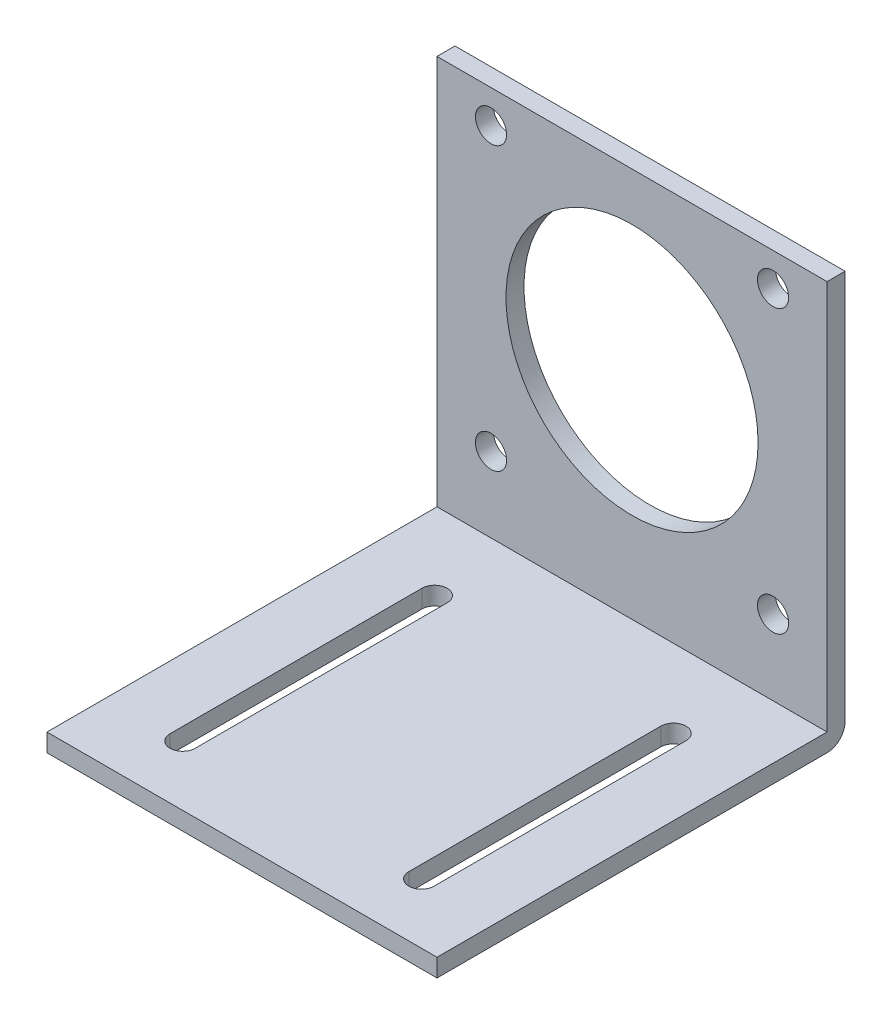
ISO-10303-21;
HEADER;
FILE_DESCRIPTION(('STEP AP214'),'2;1');
FILE_NAME('part.step','',(''),(''),'','','');
FILE_SCHEMA(('AUTOMOTIVE_DESIGN { 1 0 10303 214 1 1 1 1 }'));
ENDSEC;
DATA;
#1=APPLICATION_CONTEXT('core data for automotive mechanical design processes');
#2=APPLICATION_PROTOCOL_DEFINITION('international standard','automotive_design',2000,#1);
#3=PRODUCT_CONTEXT('',#1,'mechanical');
#4=PRODUCT('Part','Part','',(#3));
#5=PRODUCT_RELATED_PRODUCT_CATEGORY('part','',(#4));
#6=PRODUCT_DEFINITION_FORMATION('','',#4);
#7=PRODUCT_DEFINITION_CONTEXT('part definition',#1,'design');
#8=PRODUCT_DEFINITION('design','',#6,#7);
#9=PRODUCT_DEFINITION_SHAPE('','',#8);
#10=(LENGTH_UNIT() NAMED_UNIT(*) SI_UNIT(.MILLI.,.METRE.));
#11=(NAMED_UNIT(*) PLANE_ANGLE_UNIT() SI_UNIT($,.RADIAN.));
#12=(NAMED_UNIT(*) SI_UNIT($,.STERADIAN.) SOLID_ANGLE_UNIT());
#13=UNCERTAINTY_MEASURE_WITH_UNIT(LENGTH_MEASURE(1.E-05),#10,'distance_accuracy_value','');
#14=(GEOMETRIC_REPRESENTATION_CONTEXT(3) GLOBAL_UNCERTAINTY_ASSIGNED_CONTEXT((#13)) GLOBAL_UNIT_ASSIGNED_CONTEXT((#10,
#11,#12)) REPRESENTATION_CONTEXT('',''));
#15=CARTESIAN_POINT('',(0.,0.,0.));
#16=DIRECTION('',(0.,0.,1.));
#17=DIRECTION('',(1.,0.,0.));
#18=AXIS2_PLACEMENT_3D('',#15,#16,#17);
#19=CARTESIAN_POINT('',(0.,0.,3.));
#20=DIRECTION('',(0.,0.,1.));
#21=DIRECTION('',(1.,0.,0.));
#22=AXIS2_PLACEMENT_3D('',#19,#20,#21);
#23=PLANE('',#22);
#24=DIRECTION('',(-1.,0.,0.));
#25=VECTOR('',#24,1.);
#26=CARTESIAN_POINT('',(-32.5,-31.,3.));
#27=LINE('',#26,#25);
#28=CARTESIAN_POINT('',(32.5,-31.,3.));
#29=VERTEX_POINT('',#28);
#30=CARTESIAN_POINT('',(-32.5,-31.,3.));
#31=VERTEX_POINT('',#30);
#32=EDGE_CURVE('E245',#29,#31,#27,.T.);
#33=ORIENTED_EDGE('',*,*,#32,.F.);
#34=DIRECTION('',(0.,1.,0.));
#35=VECTOR('',#34,1.);
#36=CARTESIAN_POINT('',(32.5,34.,3.));
#37=LINE('',#36,#35);
#38=CARTESIAN_POINT('',(32.5,34.,3.));
#39=VERTEX_POINT('',#38);
#40=EDGE_CURVE('E312',#29,#39,#37,.T.);
#41=ORIENTED_EDGE('',*,*,#40,.T.);
#42=DIRECTION('',(-1.,0.,0.));
#43=VECTOR('',#42,1.);
#44=CARTESIAN_POINT('',(-32.5,34.,3.));
#45=LINE('',#44,#43);
#46=CARTESIAN_POINT('',(-32.5,34.,3.));
#47=VERTEX_POINT('',#46);
#48=EDGE_CURVE('E315',#39,#47,#45,.T.);
#49=ORIENTED_EDGE('',*,*,#48,.T.);
#50=DIRECTION('',(0.,-1.,0.));
#51=VECTOR('',#50,1.);
#52=CARTESIAN_POINT('',(-32.5,34.,3.));
#53=LINE('',#52,#51);
#54=EDGE_CURVE('E319',#47,#31,#53,.T.);
#55=ORIENTED_EDGE('',*,*,#54,.T.);
#56=EDGE_LOOP('',(#33,#41,#49,#55));
#57=FACE_BOUND('',#56,.T.);
#58=CARTESIAN_POINT('',(-23.5,-18.5,3.));
#59=DIRECTION('',(0.,0.,1.));
#60=DIRECTION('',(1.,0.,0.));
#61=AXIS2_PLACEMENT_3D('',#58,#59,#60);
#62=CIRCLE('',#61,2.6);
#63=CARTESIAN_POINT('',(-20.9,-18.5,3.));
#64=VERTEX_POINT('',#63);
#65=EDGE_CURVE('E280',#64,#64,#62,.T.);
#66=ORIENTED_EDGE('',*,*,#65,.F.);
#67=EDGE_LOOP('',(#66));
#68=FACE_BOUND('',#67,.T.);
#69=CARTESIAN_POINT('',(23.5,28.5,3.));
#70=DIRECTION('',(0.,0.,1.));
#71=DIRECTION('',(1.,0.,0.));
#72=AXIS2_PLACEMENT_3D('',#69,#70,#71);
#73=CIRCLE('',#72,2.6);
#74=CARTESIAN_POINT('',(26.1,28.5,3.));
#75=VERTEX_POINT('',#74);
#76=EDGE_CURVE('E296',#75,#75,#73,.T.);
#77=ORIENTED_EDGE('',*,*,#76,.F.);
#78=EDGE_LOOP('',(#77));
#79=FACE_BOUND('',#78,.T.);
#80=CARTESIAN_POINT('',(0.,4.99999999999999,3.));
#81=DIRECTION('',(0.,0.,1.));
#82=DIRECTION('',(1.,0.,0.));
#83=AXIS2_PLACEMENT_3D('',#80,#81,#82);
#84=CIRCLE('',#83,21.);
#85=CARTESIAN_POINT('',(21.,4.99999999999999,3.));
#86=VERTEX_POINT('',#85);
#87=EDGE_CURVE('E304',#86,#86,#84,.T.);
#88=ORIENTED_EDGE('',*,*,#87,.F.);
#89=EDGE_LOOP('',(#88));
#90=FACE_BOUND('',#89,.T.);
#91=CARTESIAN_POINT('',(-23.5,28.5,3.));
#92=DIRECTION('',(0.,0.,1.));
#93=DIRECTION('',(1.,0.,0.));
#94=AXIS2_PLACEMENT_3D('',#91,#92,#93);
#95=CIRCLE('',#94,2.6);
#96=CARTESIAN_POINT('',(-20.9,28.5,3.));
#97=VERTEX_POINT('',#96);
#98=EDGE_CURVE('E288',#97,#97,#95,.T.);
#99=ORIENTED_EDGE('',*,*,#98,.F.);
#100=EDGE_LOOP('',(#99));
#101=FACE_BOUND('',#100,.T.);
#102=CARTESIAN_POINT('',(23.5,-18.5,3.));
#103=DIRECTION('',(0.,0.,1.));
#104=DIRECTION('',(1.,0.,0.));
#105=AXIS2_PLACEMENT_3D('',#102,#103,#104);
#106=CIRCLE('',#105,2.6);
#107=CARTESIAN_POINT('',(26.1,-18.5,3.));
#108=VERTEX_POINT('',#107);
#109=EDGE_CURVE('E272',#108,#108,#106,.T.);
#110=ORIENTED_EDGE('',*,*,#109,.F.);
#111=EDGE_LOOP('',(#110));
#112=FACE_BOUND('',#111,.T.);
#113=ADVANCED_FACE('F39',(#57,#68,#79,#90,#101,#112),#23,.T.);
#114=CARTESIAN_POINT('',(0.,0.,0.));
#115=DIRECTION('',(0.,0.,1.));
#116=DIRECTION('',(1.,0.,0.));
#117=AXIS2_PLACEMENT_3D('',#114,#115,#116);
#118=PLANE('',#117);
#119=DIRECTION('',(0.,1.,0.));
#120=VECTOR('',#119,1.);
#121=CARTESIAN_POINT('',(32.5,34.,0.));
#122=LINE('',#121,#120);
#123=CARTESIAN_POINT('',(32.5,-31.,0.));
#124=VERTEX_POINT('',#123);
#125=CARTESIAN_POINT('',(32.5,34.,0.));
#126=VERTEX_POINT('',#125);
#127=EDGE_CURVE('E308',#124,#126,#122,.T.);
#128=ORIENTED_EDGE('',*,*,#127,.F.);
#129=DIRECTION('',(1.,0.,0.));
#130=VECTOR('',#129,1.);
#131=CARTESIAN_POINT('',(0.,-31.,0.));
#132=LINE('',#131,#130);
#133=CARTESIAN_POINT('',(-32.5,-31.,0.));
#134=VERTEX_POINT('',#133);
#135=EDGE_CURVE('E48',#124,#134,#132,.F.);
#136=ORIENTED_EDGE('',*,*,#135,.T.);
#137=DIRECTION('',(0.,-1.,0.));
#138=VECTOR('',#137,1.);
#139=CARTESIAN_POINT('',(-32.5,34.,0.));
#140=LINE('',#139,#138);
#141=CARTESIAN_POINT('',(-32.5,34.,0.));
#142=VERTEX_POINT('',#141);
#143=EDGE_CURVE('E316',#142,#134,#140,.T.);
#144=ORIENTED_EDGE('',*,*,#143,.F.);
#145=DIRECTION('',(-1.,0.,0.));
#146=VECTOR('',#145,1.);
#147=CARTESIAN_POINT('',(-32.5,34.,0.));
#148=LINE('',#147,#146);
#149=EDGE_CURVE('E325',#126,#142,#148,.T.);
#150=ORIENTED_EDGE('',*,*,#149,.F.);
#151=EDGE_LOOP('',(#128,#136,#144,#150));
#152=FACE_BOUND('',#151,.T.);
#153=CARTESIAN_POINT('',(0.,4.99999999999999,0.));
#154=DIRECTION('',(0.,0.,1.));
#155=DIRECTION('',(1.,0.,0.));
#156=AXIS2_PLACEMENT_3D('',#153,#154,#155);
#157=CIRCLE('',#156,21.);
#158=CARTESIAN_POINT('',(21.,4.99999999999999,0.));
#159=VERTEX_POINT('',#158);
#160=EDGE_CURVE('E300',#159,#159,#157,.T.);
#161=ORIENTED_EDGE('',*,*,#160,.T.);
#162=EDGE_LOOP('',(#161));
#163=FACE_BOUND('',#162,.T.);
#164=CARTESIAN_POINT('',(23.5,28.5,0.));
#165=DIRECTION('',(0.,0.,1.));
#166=DIRECTION('',(1.,0.,0.));
#167=AXIS2_PLACEMENT_3D('',#164,#165,#166);
#168=CIRCLE('',#167,2.6);
#169=CARTESIAN_POINT('',(26.1,28.5,0.));
#170=VERTEX_POINT('',#169);
#171=EDGE_CURVE('E292',#170,#170,#168,.T.);
#172=ORIENTED_EDGE('',*,*,#171,.T.);
#173=EDGE_LOOP('',(#172));
#174=FACE_BOUND('',#173,.T.);
#175=CARTESIAN_POINT('',(-23.5,28.5,0.));
#176=DIRECTION('',(0.,0.,1.));
#177=DIRECTION('',(1.,0.,0.));
#178=AXIS2_PLACEMENT_3D('',#175,#176,#177);
#179=CIRCLE('',#178,2.6);
#180=CARTESIAN_POINT('',(-20.9,28.5,0.));
#181=VERTEX_POINT('',#180);
#182=EDGE_CURVE('E284',#181,#181,#179,.T.);
#183=ORIENTED_EDGE('',*,*,#182,.T.);
#184=EDGE_LOOP('',(#183));
#185=FACE_BOUND('',#184,.T.);
#186=CARTESIAN_POINT('',(-23.5,-18.5,0.));
#187=DIRECTION('',(0.,0.,1.));
#188=DIRECTION('',(1.,0.,0.));
#189=AXIS2_PLACEMENT_3D('',#186,#187,#188);
#190=CIRCLE('',#189,2.6);
#191=CARTESIAN_POINT('',(-20.9,-18.5,0.));
#192=VERTEX_POINT('',#191);
#193=EDGE_CURVE('E276',#192,#192,#190,.T.);
#194=ORIENTED_EDGE('',*,*,#193,.T.);
#195=EDGE_LOOP('',(#194));
#196=FACE_BOUND('',#195,.T.);
#197=CARTESIAN_POINT('',(23.5,-18.5,0.));
#198=DIRECTION('',(0.,0.,1.));
#199=DIRECTION('',(1.,0.,0.));
#200=AXIS2_PLACEMENT_3D('',#197,#198,#199);
#201=CIRCLE('',#200,2.6);
#202=CARTESIAN_POINT('',(26.1,-18.5,0.));
#203=VERTEX_POINT('',#202);
#204=EDGE_CURVE('E271',#203,#203,#201,.T.);
#205=ORIENTED_EDGE('',*,*,#204,.T.);
#206=EDGE_LOOP('',(#205));
#207=FACE_BOUND('',#206,.T.);
#208=ADVANCED_FACE('F374',(#152,#163,#174,#185,#196,#207),#118,.F.);
#209=CARTESIAN_POINT('',(32.5,34.,3.));
#210=DIRECTION('',(-1.,0.,0.));
#211=DIRECTION('',(0.,-1.,0.));
#212=AXIS2_PLACEMENT_3D('',#209,#210,#211);
#213=PLANE('',#212);
#214=DIRECTION('',(0.,0.,-1.));
#215=VECTOR('',#214,1.);
#216=CARTESIAN_POINT('',(32.5,-34.,3.));
#217=LINE('',#216,#215);
#218=CARTESIAN_POINT('',(32.5,-34.,68.));
#219=VERTEX_POINT('',#218);
#220=CARTESIAN_POINT('',(32.5,-34.,3.));
#221=VERTEX_POINT('',#220);
#222=EDGE_CURVE('E322',#219,#221,#217,.T.);
#223=ORIENTED_EDGE('',*,*,#222,.T.);
#224=CARTESIAN_POINT('',(32.5,-31.,3.));
#225=DIRECTION('',(-1.,0.,0.));
#226=DIRECTION('',(0.,-1.,0.));
#227=AXIS2_PLACEMENT_3D('',#224,#225,#226);
#228=CIRCLE('',#227,3.);
#229=EDGE_CURVE('E62',#221,#124,#228,.F.);
#230=ORIENTED_EDGE('',*,*,#229,.T.);
#231=ORIENTED_EDGE('',*,*,#127,.T.);
#232=DIRECTION('',(0.,0.,-1.));
#233=VECTOR('',#232,1.);
#234=CARTESIAN_POINT('',(32.5,34.,3.));
#235=LINE('',#234,#233);
#236=EDGE_CURVE('E340',#39,#126,#235,.T.);
#237=ORIENTED_EDGE('',*,*,#236,.F.);
#238=ORIENTED_EDGE('',*,*,#40,.F.);
#239=DIRECTION('',(0.,0.,-1.));
#240=VECTOR('',#239,1.);
#241=CARTESIAN_POINT('',(32.5,-31.,68.));
#242=LINE('',#241,#240);
#243=CARTESIAN_POINT('',(32.5,-31.,68.));
#244=VERTEX_POINT('',#243);
#245=EDGE_CURVE('E267',#244,#29,#242,.T.);
#246=ORIENTED_EDGE('',*,*,#245,.F.);
#247=DIRECTION('',(0.,1.,0.));
#248=VECTOR('',#247,1.);
#249=CARTESIAN_POINT('',(32.5,-34.,68.));
#250=LINE('',#249,#248);
#251=EDGE_CURVE('E254',#219,#244,#250,.T.);
#252=ORIENTED_EDGE('',*,*,#251,.F.);
#253=EDGE_LOOP('',(#223,#230,#231,#237,#238,#246,#252));
#254=FACE_BOUND('',#253,.T.);
#255=ADVANCED_FACE('F357',(#254),#213,.F.);
#256=CARTESIAN_POINT('',(-32.5,34.,3.));
#257=DIRECTION('',(0.,-1.,0.));
#258=DIRECTION('',(0.,0.,-1.));
#259=AXIS2_PLACEMENT_3D('',#256,#257,#258);
#260=PLANE('',#259);
#261=ORIENTED_EDGE('',*,*,#149,.T.);
#262=DIRECTION('',(0.,0.,-1.));
#263=VECTOR('',#262,1.);
#264=CARTESIAN_POINT('',(-32.5,34.,3.));
#265=LINE('',#264,#263);
#266=EDGE_CURVE('E336',#47,#142,#265,.T.);
#267=ORIENTED_EDGE('',*,*,#266,.F.);
#268=ORIENTED_EDGE('',*,*,#48,.F.);
#269=ORIENTED_EDGE('',*,*,#236,.T.);
#270=EDGE_LOOP('',(#261,#267,#268,#269));
#271=FACE_BOUND('',#270,.T.);
#272=ADVANCED_FACE('F391',(#271),#260,.F.);
#273=CARTESIAN_POINT('',(-32.5,34.,3.));
#274=DIRECTION('',(1.,0.,0.));
#275=DIRECTION('',(0.,0.,-1.));
#276=AXIS2_PLACEMENT_3D('',#273,#274,#275);
#277=PLANE('',#276);
#278=ORIENTED_EDGE('',*,*,#143,.T.);
#279=CARTESIAN_POINT('',(-32.5,-31.,3.));
#280=DIRECTION('',(1.,0.,0.));
#281=DIRECTION('',(0.,0.,-1.));
#282=AXIS2_PLACEMENT_3D('',#279,#280,#281);
#283=CIRCLE('',#282,3.);
#284=CARTESIAN_POINT('',(-32.5,-34.,3.));
#285=VERTEX_POINT('',#284);
#286=EDGE_CURVE('E11',#134,#285,#283,.F.);
#287=ORIENTED_EDGE('',*,*,#286,.T.);
#288=DIRECTION('',(0.,0.,-1.));
#289=VECTOR('',#288,1.);
#290=CARTESIAN_POINT('',(-32.5,-34.,3.));
#291=LINE('',#290,#289);
#292=CARTESIAN_POINT('',(-32.5,-34.,68.));
#293=VERTEX_POINT('',#292);
#294=EDGE_CURVE('E332',#293,#285,#291,.T.);
#295=ORIENTED_EDGE('',*,*,#294,.F.);
#296=DIRECTION('',(0.,-1.,0.));
#297=VECTOR('',#296,1.);
#298=CARTESIAN_POINT('',(-32.5,-34.,68.));
#299=LINE('',#298,#297);
#300=CARTESIAN_POINT('',(-32.5,-31.,68.));
#301=VERTEX_POINT('',#300);
#302=EDGE_CURVE('E246',#301,#293,#299,.T.);
#303=ORIENTED_EDGE('',*,*,#302,.F.);
#304=DIRECTION('',(0.,0.,-1.));
#305=VECTOR('',#304,1.);
#306=CARTESIAN_POINT('',(-32.5,-31.,68.));
#307=LINE('',#306,#305);
#308=EDGE_CURVE('E260',#301,#31,#307,.T.);
#309=ORIENTED_EDGE('',*,*,#308,.T.);
#310=ORIENTED_EDGE('',*,*,#54,.F.);
#311=ORIENTED_EDGE('',*,*,#266,.T.);
#312=EDGE_LOOP('',(#278,#287,#295,#303,#309,#310,#311));
#313=FACE_BOUND('',#312,.T.);
#314=ADVANCED_FACE('F366',(#313),#277,.F.);
#315=CARTESIAN_POINT('',(-32.5,-34.,3.));
#316=DIRECTION('',(0.,1.,0.));
#317=DIRECTION('',(0.,0.,1.));
#318=AXIS2_PLACEMENT_3D('',#315,#316,#317);
#319=PLANE('',#318);
#320=DIRECTION('',(0.,0.,-1.));
#321=VECTOR('',#320,1.);
#322=CARTESIAN_POINT('',(22.,-34.,2.99999999999999));
#323=LINE('',#322,#321);
#324=CARTESIAN_POINT('',(22.,-34.,58.));
#325=VERTEX_POINT('',#324);
#326=CARTESIAN_POINT('',(22.,-34.,16.));
#327=VERTEX_POINT('',#326);
#328=EDGE_CURVE('E237',#325,#327,#323,.T.);
#329=ORIENTED_EDGE('',*,*,#328,.T.);
#330=CARTESIAN_POINT('',(19.9,-34.,16.));
#331=DIRECTION('',(0.,1.,0.));
#332=DIRECTION('',(0.,0.,1.));
#333=AXIS2_PLACEMENT_3D('',#330,#331,#332);
#334=CIRCLE('',#333,2.1);
#335=CARTESIAN_POINT('',(17.8,-34.,16.));
#336=VERTEX_POINT('',#335);
#337=EDGE_CURVE('E241',#327,#336,#334,.T.);
#338=ORIENTED_EDGE('',*,*,#337,.T.);
#339=DIRECTION('',(0.,0.,1.));
#340=VECTOR('',#339,1.);
#341=CARTESIAN_POINT('',(17.8,-34.,3.));
#342=LINE('',#341,#340);
#343=CARTESIAN_POINT('',(17.8,-34.,58.));
#344=VERTEX_POINT('',#343);
#345=EDGE_CURVE('E232',#336,#344,#342,.T.);
#346=ORIENTED_EDGE('',*,*,#345,.T.);
#347=CARTESIAN_POINT('',(19.9,-34.,58.));
#348=DIRECTION('',(0.,1.,0.));
#349=DIRECTION('',(0.,0.,1.));
#350=AXIS2_PLACEMENT_3D('',#347,#348,#349);
#351=CIRCLE('',#350,2.1);
#352=EDGE_CURVE('E154',#344,#325,#351,.T.);
#353=ORIENTED_EDGE('',*,*,#352,.T.);
#354=EDGE_LOOP('',(#329,#338,#346,#353));
#355=FACE_BOUND('',#354,.T.);
#356=DIRECTION('',(0.,0.,-1.));
#357=VECTOR('',#356,1.);
#358=CARTESIAN_POINT('',(-17.8,-34.,3.));
#359=LINE('',#358,#357);
#360=CARTESIAN_POINT('',(-17.8,-34.,58.));
#361=VERTEX_POINT('',#360);
#362=CARTESIAN_POINT('',(-17.8,-34.,16.));
#363=VERTEX_POINT('',#362);
#364=EDGE_CURVE('E224',#361,#363,#359,.T.);
#365=ORIENTED_EDGE('',*,*,#364,.T.);
#366=CARTESIAN_POINT('',(-19.9,-34.,16.));
#367=DIRECTION('',(0.,1.,0.));
#368=DIRECTION('',(0.,0.,1.));
#369=AXIS2_PLACEMENT_3D('',#366,#367,#368);
#370=CIRCLE('',#369,2.1);
#371=CARTESIAN_POINT('',(-22.,-34.,16.));
#372=VERTEX_POINT('',#371);
#373=EDGE_CURVE('E228',#363,#372,#370,.T.);
#374=ORIENTED_EDGE('',*,*,#373,.T.);
#375=DIRECTION('',(0.,0.,1.));
#376=VECTOR('',#375,1.);
#377=CARTESIAN_POINT('',(-22.,-34.,3.));
#378=LINE('',#377,#376);
#379=CARTESIAN_POINT('',(-22.,-34.,58.));
#380=VERTEX_POINT('',#379);
#381=EDGE_CURVE('E184',#372,#380,#378,.T.);
#382=ORIENTED_EDGE('',*,*,#381,.T.);
#383=CARTESIAN_POINT('',(-19.9,-34.,58.));
#384=DIRECTION('',(0.,1.,0.));
#385=DIRECTION('',(0.,0.,1.));
#386=AXIS2_PLACEMENT_3D('',#383,#384,#385);
#387=CIRCLE('',#386,2.1);
#388=EDGE_CURVE('E220',#380,#361,#387,.T.);
#389=ORIENTED_EDGE('',*,*,#388,.T.);
#390=EDGE_LOOP('',(#365,#374,#382,#389));
#391=FACE_BOUND('',#390,.T.);
#392=ORIENTED_EDGE('',*,*,#294,.T.);
#393=DIRECTION('',(1.,0.,0.));
#394=VECTOR('',#393,1.);
#395=CARTESIAN_POINT('',(-32.5,-34.,3.));
#396=LINE('',#395,#394);
#397=EDGE_CURVE('E344',#285,#221,#396,.T.);
#398=ORIENTED_EDGE('',*,*,#397,.T.);
#399=ORIENTED_EDGE('',*,*,#222,.F.);
#400=DIRECTION('',(1.,0.,0.));
#401=VECTOR('',#400,1.);
#402=CARTESIAN_POINT('',(-32.5,-34.,68.));
#403=LINE('',#402,#401);
#404=EDGE_CURVE('E250',#293,#219,#403,.T.);
#405=ORIENTED_EDGE('',*,*,#404,.F.);
#406=EDGE_LOOP('',(#392,#398,#399,#405));
#407=FACE_BOUND('',#406,.T.);
#408=ADVANCED_FACE('F352',(#355,#391,#407),#319,.F.);
#409=CARTESIAN_POINT('',(0.,4.99999999999999,3.));
#410=DIRECTION('',(0.,0.,-1.));
#411=DIRECTION('',(-1.,0.,0.));
#412=AXIS2_PLACEMENT_3D('',#409,#410,#411);
#413=CYLINDRICAL_SURFACE('',#412,21.);
#414=ORIENTED_EDGE('',*,*,#87,.T.);
#415=EDGE_LOOP('',(#414));
#416=FACE_BOUND('',#415,.T.);
#417=ORIENTED_EDGE('',*,*,#160,.F.);
#418=EDGE_LOOP('',(#417));
#419=FACE_BOUND('',#418,.T.);
#420=ADVANCED_FACE('F383',(#416,#419),#413,.F.);
#421=CARTESIAN_POINT('',(23.5,28.5,3.));
#422=DIRECTION('',(0.,0.,-1.));
#423=DIRECTION('',(-1.,0.,0.));
#424=AXIS2_PLACEMENT_3D('',#421,#422,#423);
#425=CYLINDRICAL_SURFACE('',#424,2.6);
#426=ORIENTED_EDGE('',*,*,#76,.T.);
#427=EDGE_LOOP('',(#426));
#428=FACE_BOUND('',#427,.T.);
#429=ORIENTED_EDGE('',*,*,#171,.F.);
#430=EDGE_LOOP('',(#429));
#431=FACE_BOUND('',#430,.T.);
#432=ADVANCED_FACE('F417',(#428,#431),#425,.F.);
#433=CARTESIAN_POINT('',(-23.5,28.5,3.));
#434=DIRECTION('',(0.,0.,-1.));
#435=DIRECTION('',(-1.,0.,0.));
#436=AXIS2_PLACEMENT_3D('',#433,#434,#435);
#437=CYLINDRICAL_SURFACE('',#436,2.6);
#438=ORIENTED_EDGE('',*,*,#98,.T.);
#439=EDGE_LOOP('',(#438));
#440=FACE_BOUND('',#439,.T.);
#441=ORIENTED_EDGE('',*,*,#182,.F.);
#442=EDGE_LOOP('',(#441));
#443=FACE_BOUND('',#442,.T.);
#444=ADVANCED_FACE('F424',(#440,#443),#437,.F.);
#445=CARTESIAN_POINT('',(-23.5,-18.5,3.));
#446=DIRECTION('',(0.,0.,-1.));
#447=DIRECTION('',(-1.,0.,0.));
#448=AXIS2_PLACEMENT_3D('',#445,#446,#447);
#449=CYLINDRICAL_SURFACE('',#448,2.6);
#450=ORIENTED_EDGE('',*,*,#65,.T.);
#451=EDGE_LOOP('',(#450));
#452=FACE_BOUND('',#451,.T.);
#453=ORIENTED_EDGE('',*,*,#193,.F.);
#454=EDGE_LOOP('',(#453));
#455=FACE_BOUND('',#454,.T.);
#456=ADVANCED_FACE('F431',(#452,#455),#449,.F.);
#457=CARTESIAN_POINT('',(23.5,-18.5,3.));
#458=DIRECTION('',(0.,0.,-1.));
#459=DIRECTION('',(-1.,0.,0.));
#460=AXIS2_PLACEMENT_3D('',#457,#458,#459);
#461=CYLINDRICAL_SURFACE('',#460,2.6);
#462=ORIENTED_EDGE('',*,*,#109,.T.);
#463=EDGE_LOOP('',(#462));
#464=FACE_BOUND('',#463,.T.);
#465=ORIENTED_EDGE('',*,*,#204,.F.);
#466=EDGE_LOOP('',(#465));
#467=FACE_BOUND('',#466,.T.);
#468=ADVANCED_FACE('F439',(#464,#467),#461,.F.);
#469=CARTESIAN_POINT('',(-32.5,-31.,68.));
#470=DIRECTION('',(0.,-1.,0.));
#471=DIRECTION('',(0.,0.,-1.));
#472=AXIS2_PLACEMENT_3D('',#469,#470,#471);
#473=PLANE('',#472);
#474=DIRECTION('',(0.,0.,1.));
#475=VECTOR('',#474,1.);
#476=CARTESIAN_POINT('',(17.8,-31.,16.));
#477=LINE('',#476,#475);
#478=CARTESIAN_POINT('',(17.8,-31.,16.));
#479=VERTEX_POINT('',#478);
#480=CARTESIAN_POINT('',(17.8,-31.,58.));
#481=VERTEX_POINT('',#480);
#482=EDGE_CURVE('E163',#479,#481,#477,.T.);
#483=ORIENTED_EDGE('',*,*,#482,.F.);
#484=CARTESIAN_POINT('',(19.9,-31.,16.));
#485=DIRECTION('',(0.,1.,0.));
#486=DIRECTION('',(0.,0.,1.));
#487=AXIS2_PLACEMENT_3D('',#484,#485,#486);
#488=CIRCLE('',#487,2.1);
#489=CARTESIAN_POINT('',(22.,-31.,16.));
#490=VERTEX_POINT('',#489);
#491=EDGE_CURVE('E169',#490,#479,#488,.T.);
#492=ORIENTED_EDGE('',*,*,#491,.F.);
#493=DIRECTION('',(0.,0.,-1.));
#494=VECTOR('',#493,1.);
#495=CARTESIAN_POINT('',(22.,-31.,16.));
#496=LINE('',#495,#494);
#497=CARTESIAN_POINT('',(22.,-31.,58.));
#498=VERTEX_POINT('',#497);
#499=EDGE_CURVE('E174',#498,#490,#496,.T.);
#500=ORIENTED_EDGE('',*,*,#499,.F.);
#501=CARTESIAN_POINT('',(19.9,-31.,58.));
#502=DIRECTION('',(0.,1.,0.));
#503=DIRECTION('',(0.,0.,1.));
#504=AXIS2_PLACEMENT_3D('',#501,#502,#503);
#505=CIRCLE('',#504,2.1);
#506=EDGE_CURVE('E151',#481,#498,#505,.T.);
#507=ORIENTED_EDGE('',*,*,#506,.F.);
#508=EDGE_LOOP('',(#483,#492,#500,#507));
#509=FACE_BOUND('',#508,.T.);
#510=DIRECTION('',(0.,0.,1.));
#511=VECTOR('',#510,1.);
#512=CARTESIAN_POINT('',(-22.,-31.,16.));
#513=LINE('',#512,#511);
#514=CARTESIAN_POINT('',(-22.,-31.,16.));
#515=VERTEX_POINT('',#514);
#516=CARTESIAN_POINT('',(-22.,-31.,58.));
#517=VERTEX_POINT('',#516);
#518=EDGE_CURVE('E192',#515,#517,#513,.T.);
#519=ORIENTED_EDGE('',*,*,#518,.F.);
#520=CARTESIAN_POINT('',(-19.9,-31.,16.));
#521=DIRECTION('',(0.,1.,0.));
#522=DIRECTION('',(0.,0.,-1.));
#523=AXIS2_PLACEMENT_3D('',#520,#521,#522);
#524=CIRCLE('',#523,2.1);
#525=CARTESIAN_POINT('',(-17.8,-31.,16.));
#526=VERTEX_POINT('',#525);
#527=EDGE_CURVE('E189',#526,#515,#524,.T.);
#528=ORIENTED_EDGE('',*,*,#527,.F.);
#529=DIRECTION('',(0.,0.,-1.));
#530=VECTOR('',#529,1.);
#531=CARTESIAN_POINT('',(-17.8,-31.,16.));
#532=LINE('',#531,#530);
#533=CARTESIAN_POINT('',(-17.8,-31.,58.));
#534=VERTEX_POINT('',#533);
#535=EDGE_CURVE('E200',#534,#526,#532,.T.);
#536=ORIENTED_EDGE('',*,*,#535,.F.);
#537=CARTESIAN_POINT('',(-19.9,-31.,58.));
#538=DIRECTION('',(0.,1.,0.));
#539=DIRECTION('',(0.,0.,-1.));
#540=AXIS2_PLACEMENT_3D('',#537,#538,#539);
#541=CIRCLE('',#540,2.1);
#542=EDGE_CURVE('E196',#517,#534,#541,.T.);
#543=ORIENTED_EDGE('',*,*,#542,.F.);
#544=EDGE_LOOP('',(#519,#528,#536,#543));
#545=FACE_BOUND('',#544,.T.);
#546=ORIENTED_EDGE('',*,*,#32,.T.);
#547=ORIENTED_EDGE('',*,*,#308,.F.);
#548=DIRECTION('',(-1.,0.,0.));
#549=VECTOR('',#548,1.);
#550=CARTESIAN_POINT('',(-32.5,-31.,68.));
#551=LINE('',#550,#549);
#552=EDGE_CURVE('E257',#244,#301,#551,.T.);
#553=ORIENTED_EDGE('',*,*,#552,.F.);
#554=ORIENTED_EDGE('',*,*,#245,.T.);
#555=EDGE_LOOP('',(#546,#547,#553,#554));
#556=FACE_BOUND('',#555,.T.);
#557=ADVANCED_FACE('F171',(#509,#545,#556),#473,.F.);
#558=CARTESIAN_POINT('',(0.,0.,68.));
#559=DIRECTION('',(0.,0.,-1.));
#560=DIRECTION('',(-1.,0.,0.));
#561=AXIS2_PLACEMENT_3D('',#558,#559,#560);
#562=PLANE('',#561);
#563=ORIENTED_EDGE('',*,*,#302,.T.);
#564=ORIENTED_EDGE('',*,*,#404,.T.);
#565=ORIENTED_EDGE('',*,*,#251,.T.);
#566=ORIENTED_EDGE('',*,*,#552,.T.);
#567=EDGE_LOOP('',(#563,#564,#565,#566));
#568=FACE_BOUND('',#567,.T.);
#569=ADVANCED_FACE('F362',(#568),#562,.F.);
#570=CARTESIAN_POINT('',(-19.9,-96.,16.));
#571=DIRECTION('',(0.,1.,0.));
#572=DIRECTION('',(0.,0.,1.));
#573=AXIS2_PLACEMENT_3D('',#570,#571,#572);
#574=CYLINDRICAL_SURFACE('',#573,2.1);
#575=DIRECTION('',(0.,1.,0.));
#576=VECTOR('',#575,1.);
#577=CARTESIAN_POINT('',(-17.8,-96.,16.));
#578=LINE('',#577,#576);
#579=EDGE_CURVE('E205',#363,#526,#578,.T.);
#580=ORIENTED_EDGE('',*,*,#579,.T.);
#581=ORIENTED_EDGE('',*,*,#527,.T.);
#582=DIRECTION('',(0.,1.,0.));
#583=VECTOR('',#582,1.);
#584=CARTESIAN_POINT('',(-22.,-96.,16.));
#585=LINE('',#584,#583);
#586=EDGE_CURVE('E204',#372,#515,#585,.T.);
#587=ORIENTED_EDGE('',*,*,#586,.F.);
#588=ORIENTED_EDGE('',*,*,#373,.F.);
#589=EDGE_LOOP('',(#580,#581,#587,#588));
#590=FACE_BOUND('',#589,.T.);
#591=ADVANCED_FACE('F461',(#590),#574,.F.);
#592=CARTESIAN_POINT('',(-17.8,-96.,16.));
#593=DIRECTION('',(1.,0.,0.));
#594=DIRECTION('',(0.,0.,-1.));
#595=AXIS2_PLACEMENT_3D('',#592,#593,#594);
#596=PLANE('',#595);
#597=DIRECTION('',(0.,1.,0.));
#598=VECTOR('',#597,1.);
#599=CARTESIAN_POINT('',(-17.8,-96.,58.));
#600=LINE('',#599,#598);
#601=EDGE_CURVE('E208',#361,#534,#600,.T.);
#602=ORIENTED_EDGE('',*,*,#601,.T.);
#603=ORIENTED_EDGE('',*,*,#535,.T.);
#604=ORIENTED_EDGE('',*,*,#579,.F.);
#605=ORIENTED_EDGE('',*,*,#364,.F.);
#606=EDGE_LOOP('',(#602,#603,#604,#605));
#607=FACE_BOUND('',#606,.T.);
#608=ADVANCED_FACE('F467',(#607),#596,.F.);
#609=CARTESIAN_POINT('',(-19.9,-96.,58.));
#610=DIRECTION('',(0.,1.,0.));
#611=DIRECTION('',(0.,0.,1.));
#612=AXIS2_PLACEMENT_3D('',#609,#610,#611);
#613=CYLINDRICAL_SURFACE('',#612,2.1);
#614=DIRECTION('',(0.,1.,0.));
#615=VECTOR('',#614,1.);
#616=CARTESIAN_POINT('',(-22.,-96.,58.));
#617=LINE('',#616,#615);
#618=EDGE_CURVE('E211',#380,#517,#617,.T.);
#619=ORIENTED_EDGE('',*,*,#618,.T.);
#620=ORIENTED_EDGE('',*,*,#542,.T.);
#621=ORIENTED_EDGE('',*,*,#601,.F.);
#622=ORIENTED_EDGE('',*,*,#388,.F.);
#623=EDGE_LOOP('',(#619,#620,#621,#622));
#624=FACE_BOUND('',#623,.T.);
#625=ADVANCED_FACE('F475',(#624),#613,.F.);
#626=CARTESIAN_POINT('',(-22.,-96.,16.));
#627=DIRECTION('',(-1.,0.,0.));
#628=DIRECTION('',(0.,0.,1.));
#629=AXIS2_PLACEMENT_3D('',#626,#627,#628);
#630=PLANE('',#629);
#631=ORIENTED_EDGE('',*,*,#586,.T.);
#632=ORIENTED_EDGE('',*,*,#518,.T.);
#633=ORIENTED_EDGE('',*,*,#618,.F.);
#634=ORIENTED_EDGE('',*,*,#381,.F.);
#635=EDGE_LOOP('',(#631,#632,#633,#634));
#636=FACE_BOUND('',#635,.T.);
#637=ADVANCED_FACE('F483',(#636),#630,.F.);
#638=CARTESIAN_POINT('',(19.9,-96.,16.));
#639=DIRECTION('',(0.,1.,0.));
#640=DIRECTION('',(0.,0.,1.));
#641=AXIS2_PLACEMENT_3D('',#638,#639,#640);
#642=CYLINDRICAL_SURFACE('',#641,2.1);
#643=DIRECTION('',(0.,1.,0.));
#644=VECTOR('',#643,1.);
#645=CARTESIAN_POINT('',(22.,-96.,16.));
#646=LINE('',#645,#644);
#647=EDGE_CURVE('E181',#327,#490,#646,.T.);
#648=ORIENTED_EDGE('',*,*,#647,.T.);
#649=ORIENTED_EDGE('',*,*,#491,.T.);
#650=DIRECTION('',(0.,1.,0.));
#651=VECTOR('',#650,1.);
#652=CARTESIAN_POINT('',(17.8,-96.,16.));
#653=LINE('',#652,#651);
#654=EDGE_CURVE('E159',#336,#479,#653,.T.);
#655=ORIENTED_EDGE('',*,*,#654,.F.);
#656=ORIENTED_EDGE('',*,*,#337,.F.);
#657=EDGE_LOOP('',(#648,#649,#655,#656));
#658=FACE_BOUND('',#657,.T.);
#659=ADVANCED_FACE('F491',(#658),#642,.F.);
#660=CARTESIAN_POINT('',(22.,-96.,16.));
#661=DIRECTION('',(1.,0.,0.));
#662=DIRECTION('',(0.,0.,-1.));
#663=AXIS2_PLACEMENT_3D('',#660,#661,#662);
#664=PLANE('',#663);
#665=DIRECTION('',(0.,1.,0.));
#666=VECTOR('',#665,1.);
#667=CARTESIAN_POINT('',(22.,-96.,58.));
#668=LINE('',#667,#666);
#669=EDGE_CURVE('E158',#325,#498,#668,.T.);
#670=ORIENTED_EDGE('',*,*,#669,.T.);
#671=ORIENTED_EDGE('',*,*,#499,.T.);
#672=ORIENTED_EDGE('',*,*,#647,.F.);
#673=ORIENTED_EDGE('',*,*,#328,.F.);
#674=EDGE_LOOP('',(#670,#671,#672,#673));
#675=FACE_BOUND('',#674,.T.);
#676=ADVANCED_FACE('F499',(#675),#664,.F.);
#677=CARTESIAN_POINT('',(19.9,-96.,58.));
#678=DIRECTION('',(0.,1.,0.));
#679=DIRECTION('',(0.,0.,1.));
#680=AXIS2_PLACEMENT_3D('',#677,#678,#679);
#681=CYLINDRICAL_SURFACE('',#680,2.1);
#682=DIRECTION('',(0.,1.,0.));
#683=VECTOR('',#682,1.);
#684=CARTESIAN_POINT('',(17.8,-96.,58.));
#685=LINE('',#684,#683);
#686=EDGE_CURVE('E146',#344,#481,#685,.T.);
#687=ORIENTED_EDGE('',*,*,#686,.T.);
#688=ORIENTED_EDGE('',*,*,#506,.T.);
#689=ORIENTED_EDGE('',*,*,#669,.F.);
#690=ORIENTED_EDGE('',*,*,#352,.F.);
#691=EDGE_LOOP('',(#687,#688,#689,#690));
#692=FACE_BOUND('',#691,.T.);
#693=ADVANCED_FACE('F148',(#692),#681,.F.);
#694=CARTESIAN_POINT('',(17.8,-96.,16.));
#695=DIRECTION('',(-1.,0.,0.));
#696=DIRECTION('',(0.,0.,1.));
#697=AXIS2_PLACEMENT_3D('',#694,#695,#696);
#698=PLANE('',#697);
#699=ORIENTED_EDGE('',*,*,#654,.T.);
#700=ORIENTED_EDGE('',*,*,#482,.T.);
#701=ORIENTED_EDGE('',*,*,#686,.F.);
#702=ORIENTED_EDGE('',*,*,#345,.F.);
#703=EDGE_LOOP('',(#699,#700,#701,#702));
#704=FACE_BOUND('',#703,.T.);
#705=ADVANCED_FACE('F164',(#704),#698,.F.);
#706=CARTESIAN_POINT('',(-32.5,-31.,3.));
#707=DIRECTION('',(1.,0.,0.));
#708=DIRECTION('',(0.,0.,-1.));
#709=AXIS2_PLACEMENT_3D('',#706,#707,#708);
#710=CYLINDRICAL_SURFACE('',#709,3.);
#711=ORIENTED_EDGE('',*,*,#286,.F.);
#712=ORIENTED_EDGE('',*,*,#135,.F.);
#713=ORIENTED_EDGE('',*,*,#229,.F.);
#714=ORIENTED_EDGE('',*,*,#397,.F.);
#715=EDGE_LOOP('',(#711,#712,#713,#714));
#716=FACE_BOUND('',#715,.T.);
#717=ADVANCED_FACE('F41',(#716),#710,.T.);
#718=CLOSED_SHELL('',(#113,#208,#255,#272,#314,#408,#420,#432,#444,#456,#468,#557,#569,#591,
#608,#625,#637,#659,#676,#693,#705,#717));
#719=MANIFOLD_SOLID_BREP('B2',#718);
#720=ADVANCED_BREP_SHAPE_REPRESENTATION('',(#18,#719),#14);
#721=SHAPE_DEFINITION_REPRESENTATION(#9,#720);
ENDSEC;
END-ISO-10303-21;
